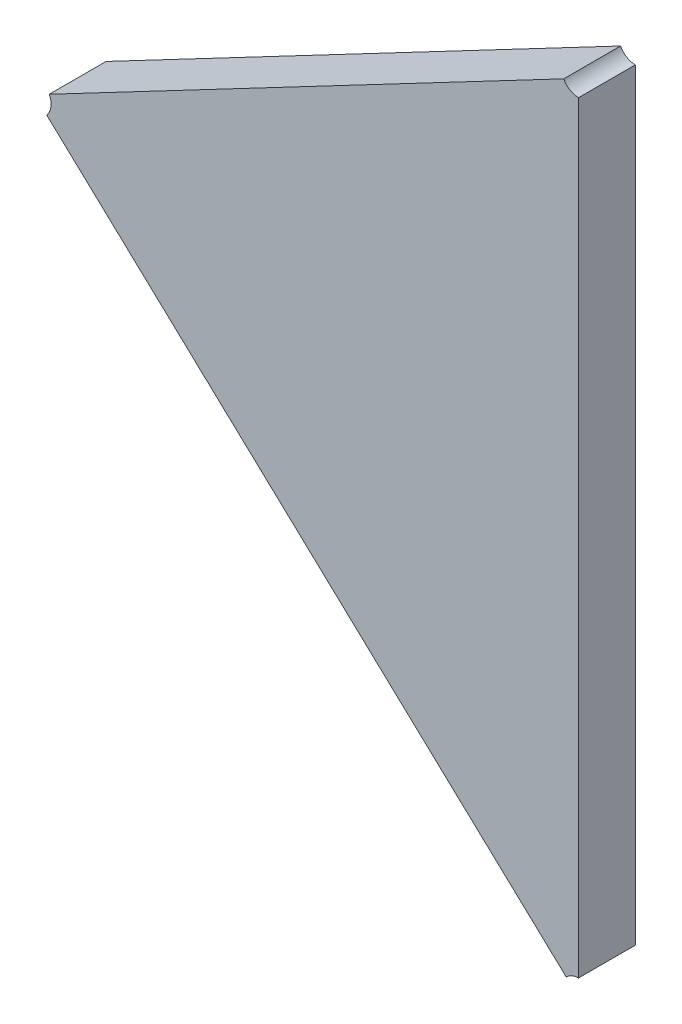
ISO-10303-21;
HEADER;
FILE_DESCRIPTION(('STEP AP214'),'2;1');
FILE_NAME('part.step','',(''),(''),'','','');
FILE_SCHEMA(('AUTOMOTIVE_DESIGN { 1 0 10303 214 1 1 1 1 }'));
ENDSEC;
DATA;
#1=APPLICATION_CONTEXT('core data for automotive mechanical design processes');
#2=APPLICATION_PROTOCOL_DEFINITION('international standard','automotive_design',2000,#1);
#3=PRODUCT_CONTEXT('',#1,'mechanical');
#4=PRODUCT('Part','Part','',(#3));
#5=PRODUCT_RELATED_PRODUCT_CATEGORY('part','',(#4));
#6=PRODUCT_DEFINITION_FORMATION('','',#4);
#7=PRODUCT_DEFINITION_CONTEXT('part definition',#1,'design');
#8=PRODUCT_DEFINITION('design','',#6,#7);
#9=PRODUCT_DEFINITION_SHAPE('','',#8);
#10=(LENGTH_UNIT() NAMED_UNIT(*) SI_UNIT(.MILLI.,.METRE.));
#11=(NAMED_UNIT(*) PLANE_ANGLE_UNIT() SI_UNIT($,.RADIAN.));
#12=(NAMED_UNIT(*) SI_UNIT($,.STERADIAN.) SOLID_ANGLE_UNIT());
#13=UNCERTAINTY_MEASURE_WITH_UNIT(LENGTH_MEASURE(1.E-05),#10,'distance_accuracy_value','');
#14=(GEOMETRIC_REPRESENTATION_CONTEXT(3) GLOBAL_UNCERTAINTY_ASSIGNED_CONTEXT((#13)) GLOBAL_UNIT_ASSIGNED_CONTEXT((#10,
#11,#12)) REPRESENTATION_CONTEXT('',''));
#15=CARTESIAN_POINT('',(0.,0.,0.));
#16=DIRECTION('',(0.,0.,1.));
#17=DIRECTION('',(1.,0.,0.));
#18=AXIS2_PLACEMENT_3D('',#15,#16,#17);
#19=CARTESIAN_POINT('',(-1.60112212022003,-1.2582287551066,0.0042));
#20=DIRECTION('',(0.,0.,1.));
#21=DIRECTION('',(1.,0.,0.));
#22=AXIS2_PLACEMENT_3D('',#19,#20,#21);
#23=PLANE('',#22);
#24=CARTESIAN_POINT('',(-1.58055983163915,-1.213451822679,0.0042));
#25=DIRECTION('',(0.,0.,-1.));
#26=DIRECTION('',(0.,-1.,0.));
#27=AXIS2_PLACEMENT_3D('',#24,#25,#26);
#28=CIRCLE('',#27,0.00200000000000002);
#29=CARTESIAN_POINT('',(-1.58055983163915,-1.215451822679,0.0042));
#30=VERTEX_POINT('',#29);
#31=CARTESIAN_POINT('',(-1.58232991057463,-1.21438285466673,0.0042));
#32=VERTEX_POINT('',#31);
#33=EDGE_CURVE('E11',#30,#32,#28,.T.);
#34=ORIENTED_EDGE('',*,*,#33,.T.);
#35=DIRECTION('',(-0.885039467737861,-0.465515993867326,0.));
#36=VECTOR('',#35,1.);
#37=CARTESIAN_POINT('',(-1.58232991057463,-1.21438285466673,0.0042));
#38=LINE('',#37,#36);
#39=CARTESIAN_POINT('',(-1.64385896919458,-1.24674611293859,0.0042));
#40=VERTEX_POINT('',#39);
#41=EDGE_CURVE('E113',#32,#40,#38,.T.);
#42=ORIENTED_EDGE('',*,*,#41,.T.);
#43=CARTESIAN_POINT('',(-1.64562904813006,-1.24767714492633,0.0042));
#44=DIRECTION('',(0.,0.,-1.));
#45=DIRECTION('',(0.885039467737208,0.465515993868567,0.));
#46=AXIS2_PLACEMENT_3D('',#43,#44,#45);
#47=CIRCLE('',#46,0.00200000000000002);
#48=CARTESIAN_POINT('',(-1.6441694044365,-1.2490444196931,0.0042));
#49=VERTEX_POINT('',#48);
#50=EDGE_CURVE('E107',#40,#49,#47,.T.);
#51=ORIENTED_EDGE('',*,*,#50,.T.);
#52=DIRECTION('',(0.729821846781324,-0.683637383384421,0.));
#53=VECTOR('',#52,1.);
#54=CARTESIAN_POINT('',(-1.6441694044365,-1.2490444196931,0.0042));
#55=LINE('',#54,#53);
#56=CARTESIAN_POINT('',(-1.58201947533271,-1.30726138743312,0.0042));
#57=VERTEX_POINT('',#56);
#58=EDGE_CURVE('E71',#49,#57,#55,.T.);
#59=ORIENTED_EDGE('',*,*,#58,.T.);
#60=CARTESIAN_POINT('',(-1.58055983163915,-1.30862866219989,0.0042));
#61=DIRECTION('',(0.,0.,-1.));
#62=DIRECTION('',(-0.729821846780401,0.683637383385406,0.));
#63=AXIS2_PLACEMENT_3D('',#60,#61,#62);
#64=CIRCLE('',#63,0.00200000000000002);
#65=CARTESIAN_POINT('',(-1.58055983163915,-1.30662866219989,0.0042));
#66=VERTEX_POINT('',#65);
#67=EDGE_CURVE('E67',#57,#66,#64,.T.);
#68=ORIENTED_EDGE('',*,*,#67,.T.);
#69=DIRECTION('',(0.,1.,0.));
#70=VECTOR('',#69,1.);
#71=CARTESIAN_POINT('',(-1.58055983163915,-1.30662866219989,0.0042));
#72=LINE('',#71,#70);
#73=EDGE_CURVE('E69',#66,#30,#72,.T.);
#74=ORIENTED_EDGE('',*,*,#73,.T.);
#75=EDGE_LOOP('',(#34,#42,#51,#59,#68,#74));
#76=FACE_BOUND('',#75,.T.);
#77=ADVANCED_FACE('F17',(#76),#23,.T.);
#78=CARTESIAN_POINT('',(-1.60108562899135,-1.25826779665778,-0.0026));
#79=DIRECTION('',(0.,0.,1.));
#80=DIRECTION('',(1.,0.,0.));
#81=AXIS2_PLACEMENT_3D('',#78,#79,#80);
#82=PLANE('',#81);
#83=CARTESIAN_POINT('',(-1.58055983163915,-1.213451822679,-0.0026));
#84=DIRECTION('',(0.,0.,1.));
#85=DIRECTION('',(-0.885039467739312,-0.465515993864567,0.));
#86=AXIS2_PLACEMENT_3D('',#83,#84,#85);
#87=CIRCLE('',#86,0.00200000000000002);
#88=CARTESIAN_POINT('',(-1.58232991057463,-1.21438285466673,-0.0026));
#89=VERTEX_POINT('',#88);
#90=CARTESIAN_POINT('',(-1.58055983163915,-1.215451822679,-0.0026));
#91=VERTEX_POINT('',#90);
#92=EDGE_CURVE('E24',#89,#91,#87,.T.);
#93=ORIENTED_EDGE('',*,*,#92,.T.);
#94=DIRECTION('',(0.,1.,0.));
#95=VECTOR('',#94,1.);
#96=CARTESIAN_POINT('',(-1.58055983163915,-1.30662866219989,-0.0026));
#97=LINE('',#96,#95);
#98=CARTESIAN_POINT('',(-1.58055983163915,-1.30662866219989,-0.0026));
#99=VERTEX_POINT('',#98);
#100=EDGE_CURVE('E109',#99,#91,#97,.T.);
#101=ORIENTED_EDGE('',*,*,#100,.F.);
#102=CARTESIAN_POINT('',(-1.58055983163915,-1.30862866219989,-0.0026));
#103=DIRECTION('',(0.,0.,1.));
#104=DIRECTION('',(0.,1.,0.));
#105=AXIS2_PLACEMENT_3D('',#102,#103,#104);
#106=CIRCLE('',#105,0.00200000000000002);
#107=CARTESIAN_POINT('',(-1.58201947533271,-1.30726138743312,-0.0026));
#108=VERTEX_POINT('',#107);
#109=EDGE_CURVE('E87',#99,#108,#106,.T.);
#110=ORIENTED_EDGE('',*,*,#109,.T.);
#111=DIRECTION('',(0.729821846781321,-0.683637383384424,0.));
#112=VECTOR('',#111,1.);
#113=CARTESIAN_POINT('',(-1.6441694044365,-1.2490444196931,-0.0026));
#114=LINE('',#113,#112);
#115=CARTESIAN_POINT('',(-1.6441694044365,-1.2490444196931,-0.0026));
#116=VERTEX_POINT('',#115);
#117=EDGE_CURVE('E75',#116,#108,#114,.T.);
#118=ORIENTED_EDGE('',*,*,#117,.F.);
#119=CARTESIAN_POINT('',(-1.64562904813006,-1.24767714492633,-0.0026));
#120=DIRECTION('',(0.,0.,1.));
#121=DIRECTION('',(0.729821846780345,-0.683637383385465,0.));
#122=AXIS2_PLACEMENT_3D('',#119,#120,#121);
#123=CIRCLE('',#122,0.00200000000000002);
#124=CARTESIAN_POINT('',(-1.64385896919458,-1.24674611293859,-0.0026));
#125=VERTEX_POINT('',#124);
#126=EDGE_CURVE('E88',#116,#125,#123,.T.);
#127=ORIENTED_EDGE('',*,*,#126,.T.);
#128=DIRECTION('',(-0.885039467737863,-0.465515993867322,0.));
#129=VECTOR('',#128,1.);
#130=CARTESIAN_POINT('',(-1.58232991057463,-1.21438285466674,-0.0026));
#131=LINE('',#130,#129);
#132=EDGE_CURVE('E103',#89,#125,#131,.T.);
#133=ORIENTED_EDGE('',*,*,#132,.F.);
#134=EDGE_LOOP('',(#93,#101,#110,#118,#127,#133));
#135=FACE_BOUND('',#134,.T.);
#136=ADVANCED_FACE('F125',(#135),#82,.F.);
#137=CARTESIAN_POINT('',(-1.58055983163915,-1.213451822679,-0.0026));
#138=DIRECTION('',(-0.465515993867324,0.885039467737862,0.));
#139=DIRECTION('',(-0.885039467737862,-0.465515993867324,0.));
#140=AXIS2_PLACEMENT_3D('',#137,#138,#139);
#141=PLANE('',#140);
#142=DIRECTION('',(0.,0.,-1.));
#143=VECTOR('',#142,1.);
#144=CARTESIAN_POINT('',(-1.58232991057463,-1.21438285466673,0.0042));
#145=LINE('',#144,#143);
#146=EDGE_CURVE('E111',#32,#89,#145,.T.);
#147=ORIENTED_EDGE('',*,*,#146,.T.);
#148=ORIENTED_EDGE('',*,*,#132,.T.);
#149=DIRECTION('',(0.,0.,1.));
#150=VECTOR('',#149,1.);
#151=CARTESIAN_POINT('',(-1.64385896919458,-1.24674611293859,-0.0026));
#152=LINE('',#151,#150);
#153=EDGE_CURVE('E97',#125,#40,#152,.T.);
#154=ORIENTED_EDGE('',*,*,#153,.T.);
#155=ORIENTED_EDGE('',*,*,#41,.F.);
#156=EDGE_LOOP('',(#147,#148,#154,#155));
#157=FACE_BOUND('',#156,.T.);
#158=ADVANCED_FACE('F118',(#157),#141,.T.);
#159=CARTESIAN_POINT('',(-1.64562904813006,-1.24767714492633,-0.0026));
#160=DIRECTION('',(-0.683637383384425,-0.729821846781321,0.));
#161=DIRECTION('',(0.729821846781321,-0.683637383384425,0.));
#162=AXIS2_PLACEMENT_3D('',#159,#160,#161);
#163=PLANE('',#162);
#164=DIRECTION('',(0.,0.,1.));
#165=VECTOR('',#164,1.);
#166=CARTESIAN_POINT('',(-1.58201947533271,-1.30726138743312,-0.0026));
#167=LINE('',#166,#165);
#168=EDGE_CURVE('E105',#108,#57,#167,.T.);
#169=ORIENTED_EDGE('',*,*,#168,.T.);
#170=ORIENTED_EDGE('',*,*,#58,.F.);
#171=DIRECTION('',(0.,0.,-1.));
#172=VECTOR('',#171,1.);
#173=CARTESIAN_POINT('',(-1.6441694044365,-1.2490444196931,0.0042));
#174=LINE('',#173,#172);
#175=EDGE_CURVE('E84',#49,#116,#174,.T.);
#176=ORIENTED_EDGE('',*,*,#175,.T.);
#177=ORIENTED_EDGE('',*,*,#117,.T.);
#178=EDGE_LOOP('',(#169,#170,#176,#177));
#179=FACE_BOUND('',#178,.T.);
#180=ADVANCED_FACE('F124',(#179),#163,.T.);
#181=CARTESIAN_POINT('',(-1.58055983163915,-1.30862866219989,-0.0026));
#182=DIRECTION('',(1.,0.,0.));
#183=DIRECTION('',(0.,1.,0.));
#184=AXIS2_PLACEMENT_3D('',#181,#182,#183);
#185=PLANE('',#184);
#186=DIRECTION('',(0.,0.,1.));
#187=VECTOR('',#186,1.);
#188=CARTESIAN_POINT('',(-1.58055983163915,-1.215451822679,-0.0026));
#189=LINE('',#188,#187);
#190=EDGE_CURVE('E83',#91,#30,#189,.T.);
#191=ORIENTED_EDGE('',*,*,#190,.T.);
#192=ORIENTED_EDGE('',*,*,#73,.F.);
#193=DIRECTION('',(0.,0.,-1.));
#194=VECTOR('',#193,1.);
#195=CARTESIAN_POINT('',(-1.58055983163915,-1.30662866219989,0.0042));
#196=LINE('',#195,#194);
#197=EDGE_CURVE('E80',#66,#99,#196,.T.);
#198=ORIENTED_EDGE('',*,*,#197,.T.);
#199=ORIENTED_EDGE('',*,*,#100,.T.);
#200=EDGE_LOOP('',(#191,#192,#198,#199));
#201=FACE_BOUND('',#200,.T.);
#202=ADVANCED_FACE('F79',(#201),#185,.T.);
#203=CARTESIAN_POINT('',(-1.64562904813006,-1.24767714492633,-0.0018));
#204=DIRECTION('',(0.,0.,1.));
#205=DIRECTION('',(0.99100082613229,-0.133855752977297,0.));
#206=AXIS2_PLACEMENT_3D('',#203,#204,#205);
#207=CYLINDRICAL_SURFACE('',#206,0.00200000000000002);
#208=ORIENTED_EDGE('',*,*,#153,.F.);
#209=ORIENTED_EDGE('',*,*,#126,.F.);
#210=ORIENTED_EDGE('',*,*,#175,.F.);
#211=ORIENTED_EDGE('',*,*,#50,.F.);
#212=EDGE_LOOP('',(#208,#209,#210,#211));
#213=FACE_BOUND('',#212,.T.);
#214=ADVANCED_FACE('F122',(#213),#207,.F.);
#215=CARTESIAN_POINT('',(-1.58055983163915,-1.30862866219989,-0.0018));
#216=DIRECTION('',(0.,0.,1.));
#217=DIRECTION('',(-1.,0.,0.));
#218=AXIS2_PLACEMENT_3D('',#215,#216,#217);
#219=CYLINDRICAL_SURFACE('',#218,0.00200000000000002);
#220=ORIENTED_EDGE('',*,*,#168,.F.);
#221=ORIENTED_EDGE('',*,*,#109,.F.);
#222=ORIENTED_EDGE('',*,*,#197,.F.);
#223=ORIENTED_EDGE('',*,*,#67,.F.);
#224=EDGE_LOOP('',(#220,#221,#222,#223));
#225=FACE_BOUND('',#224,.T.);
#226=ADVANCED_FACE('F86',(#225),#219,.F.);
#227=CARTESIAN_POINT('',(-1.58055983163915,-1.213451822679,-0.0018));
#228=DIRECTION('',(0.,0.,1.));
#229=DIRECTION('',(-1.,0.,0.));
#230=AXIS2_PLACEMENT_3D('',#227,#228,#229);
#231=CYLINDRICAL_SURFACE('',#230,0.00200000000000002);
#232=ORIENTED_EDGE('',*,*,#146,.F.);
#233=ORIENTED_EDGE('',*,*,#33,.F.);
#234=ORIENTED_EDGE('',*,*,#190,.F.);
#235=ORIENTED_EDGE('',*,*,#92,.F.);
#236=EDGE_LOOP('',(#232,#233,#234,#235));
#237=FACE_BOUND('',#236,.T.);
#238=ADVANCED_FACE('F127',(#237),#231,.F.);
#239=CLOSED_SHELL('',(#77,#136,#158,#180,#202,#214,#226,#238));
#240=MANIFOLD_SOLID_BREP('B1',#239);
#241=ADVANCED_BREP_SHAPE_REPRESENTATION('',(#18,#240),#14);
#242=SHAPE_DEFINITION_REPRESENTATION(#9,#241);
ENDSEC;
END-ISO-10303-21;
